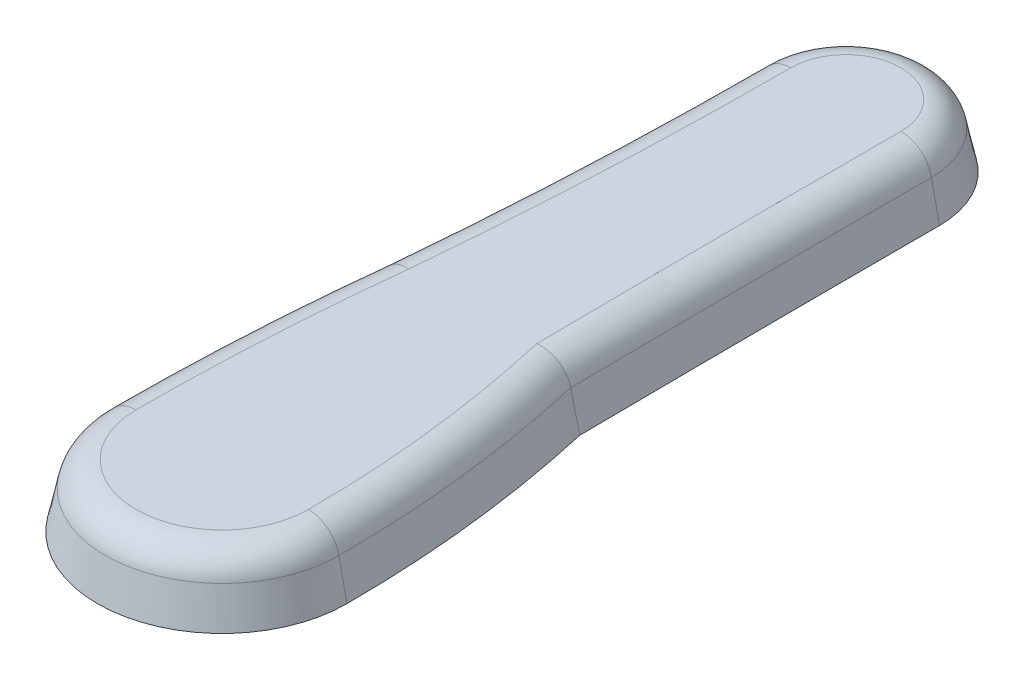
ISO-10303-21;
HEADER;
FILE_DESCRIPTION(('STEP AP214'),'2;1');
FILE_NAME('part.step','',(''),(''),'','','');
FILE_SCHEMA(('AUTOMOTIVE_DESIGN { 1 0 10303 214 1 1 1 1 }'));
ENDSEC;
DATA;
#1=APPLICATION_CONTEXT('core data for automotive mechanical design processes');
#2=APPLICATION_PROTOCOL_DEFINITION('international standard','automotive_design',2000,#1);
#3=PRODUCT_CONTEXT('',#1,'mechanical');
#4=PRODUCT('Part','Part','',(#3));
#5=PRODUCT_RELATED_PRODUCT_CATEGORY('part','',(#4));
#6=PRODUCT_DEFINITION_FORMATION('','',#4);
#7=PRODUCT_DEFINITION_CONTEXT('part definition',#1,'design');
#8=PRODUCT_DEFINITION('design','',#6,#7);
#9=PRODUCT_DEFINITION_SHAPE('','',#8);
#10=(LENGTH_UNIT() NAMED_UNIT(*) SI_UNIT(.MILLI.,.METRE.));
#11=(NAMED_UNIT(*) PLANE_ANGLE_UNIT() SI_UNIT($,.RADIAN.));
#12=(NAMED_UNIT(*) SI_UNIT($,.STERADIAN.) SOLID_ANGLE_UNIT());
#13=UNCERTAINTY_MEASURE_WITH_UNIT(LENGTH_MEASURE(1.E-05),#10,'distance_accuracy_value','');
#14=(GEOMETRIC_REPRESENTATION_CONTEXT(3) GLOBAL_UNCERTAINTY_ASSIGNED_CONTEXT((#13)) GLOBAL_UNIT_ASSIGNED_CONTEXT((#10,
#11,#12)) REPRESENTATION_CONTEXT('',''));
#15=CARTESIAN_POINT('',(0.,0.,0.));
#16=DIRECTION('',(0.,0.,1.));
#17=DIRECTION('',(1.,0.,0.));
#18=AXIS2_PLACEMENT_3D('',#15,#16,#17);
#19=CARTESIAN_POINT('',(-339.218112171444,0.,-7.49400541621981E-13));
#20=DIRECTION('',(0.,-1.,0.));
#21=DIRECTION('',(0.,0.,1.));
#22=AXIS2_PLACEMENT_3D('',#19,#20,#21);
#23=CONICAL_SURFACE('',#22,379.218112171443,0.20943951023932);
#24=CARTESIAN_POINT('',(26.313249291732,20.,-83.5886390645757));
#25=CARTESIAN_POINT('',(27.0209951168616,16.6666712777232,-83.6720068129178));
#26=CARTESIAN_POINT('',(27.7287432435103,13.3333402499073,-83.7552625379664));
#27=CARTESIAN_POINT('',(29.1442440998376,6.66667358323685,-83.9215499414755));
#28=CARTESIAN_POINT('',(29.8519968295162,3.33333794438225,-84.004581619936));
#29=CARTESIAN_POINT('',(30.5597518607139,-1.14080823309209E-11,-84.0875012751029));
#30=B_SPLINE_CURVE_WITH_KNOTS('',3,(#24,#25,#26,#27,#28,#29),.UNSPECIFIED.,.F.,.F.,(4,2,4),(0.,
10.2259675340651,20.4519350680094),.UNSPECIFIED.);
#31=CARTESIAN_POINT('',(27.995046607654,12.0791169081776,-83.7865324187301));
#32=VERTEX_POINT('',#31);
#33=CARTESIAN_POINT('',(30.5597518607073,0.,-84.0875012756157));
#34=VERTEX_POINT('',#33);
#35=EDGE_CURVE('E102',#32,#34,#30,.T.);
#36=ORIENTED_EDGE('',*,*,#35,.F.);
#37=CARTESIAN_POINT('',(-339.218112171444,12.0791169081776,-7.49400541621981E-13));
#38=DIRECTION('',(0.,-1.,0.));
#39=DIRECTION('',(0.,0.,-1.));
#40=AXIS2_PLACEMENT_3D('',#37,#38,#39);
#41=CIRCLE('',#40,376.650616613431);
#42=CARTESIAN_POINT('',(37.4325044419871,12.0791169081776,-1.49524238541269E-13));
#43=VERTEX_POINT('',#42);
#44=EDGE_CURVE('E11',#32,#43,#41,.T.);
#45=ORIENTED_EDGE('',*,*,#44,.T.);
#46=DIRECTION('',(0.207911690817759,-0.978147600733806,0.));
#47=VECTOR('',#46,1.);
#48=CARTESIAN_POINT('',(39.9999999999995,0.,-1.45435091529205E-13));
#49=LINE('',#48,#47);
#50=CARTESIAN_POINT('',(40.,0.,0.));
#51=VERTEX_POINT('',#50);
#52=EDGE_CURVE('E123',#43,#51,#49,.T.);
#53=ORIENTED_EDGE('',*,*,#52,.T.);
#54=CARTESIAN_POINT('',(-339.218112171444,0.,-7.49400541621981E-13));
#55=DIRECTION('',(0.,1.,0.));
#56=DIRECTION('',(0.,0.,1.));
#57=AXIS2_PLACEMENT_3D('',#54,#55,#56);
#58=CIRCLE('',#57,379.218112171443);
#59=EDGE_CURVE('E117',#51,#34,#58,.T.);
#60=ORIENTED_EDGE('',*,*,#59,.T.);
#61=EDGE_LOOP('',(#36,#45,#53,#60));
#62=FACE_BOUND('',#61,.T.);
#63=ADVANCED_FACE('F32',(#62),#23,.T.);
#64=CARTESIAN_POINT('',(12031.7650883575,0.,-200.000000000189));
#65=DIRECTION('',(0.,1.,0.));
#66=DIRECTION('',(0.,0.,-1.));
#67=AXIS2_PLACEMENT_3D('',#64,#65,#66);
#68=CONICAL_SURFACE('',#67,12001.7650883576,0.20943951023932);
#69=DIRECTION('',(0.207911690817759,-0.978147600733806,0.));
#70=VECTOR('',#69,1.);
#71=CARTESIAN_POINT('',(30.,0.,-200.));
#72=LINE('',#71,#70);
#73=CARTESIAN_POINT('',(27.4325044419825,12.0791169082012,-200.));
#74=VERTEX_POINT('',#73);
#75=CARTESIAN_POINT('',(30.,0.,-200.));
#76=VERTEX_POINT('',#75);
#77=EDGE_CURVE('E111',#74,#76,#72,.T.);
#78=ORIENTED_EDGE('',*,*,#77,.F.);
#79=CARTESIAN_POINT('',(12031.7650883575,12.0791169081782,-200.000000000189));
#80=DIRECTION('',(0.,1.,0.));
#81=DIRECTION('',(0.,0.,1.));
#82=AXIS2_PLACEMENT_3D('',#79,#80,#81);
#83=CIRCLE('',#82,12004.3325839156);
#84=EDGE_CURVE('E41',#74,#32,#83,.T.);
#85=ORIENTED_EDGE('',*,*,#84,.T.);
#86=ORIENTED_EDGE('',*,*,#35,.T.);
#87=CARTESIAN_POINT('',(12031.7650883575,0.,-200.000000000189));
#88=DIRECTION('',(0.,-1.,0.));
#89=DIRECTION('',(0.,0.,-1.));
#90=AXIS2_PLACEMENT_3D('',#87,#88,#89);
#91=CIRCLE('',#90,12001.7650883576);
#92=EDGE_CURVE('E105',#34,#76,#91,.T.);
#93=ORIENTED_EDGE('',*,*,#92,.T.);
#94=EDGE_LOOP('',(#78,#85,#86,#93));
#95=FACE_BOUND('',#94,.T.);
#96=ADVANCED_FACE('F104',(#95),#68,.F.);
#97=CARTESIAN_POINT('',(0.,0.,-200.));
#98=DIRECTION('',(0.,-1.,0.));
#99=DIRECTION('',(0.,0.,1.));
#100=AXIS2_PLACEMENT_3D('',#97,#98,#99);
#101=CONICAL_SURFACE('',#100,30.,0.20943951023932);
#102=DIRECTION('',(-0.207911690817759,-0.978147600733806,0.));
#103=VECTOR('',#102,1.);
#104=CARTESIAN_POINT('',(-30.,0.,-200.));
#105=LINE('',#104,#103);
#106=CARTESIAN_POINT('',(-27.4325044419876,12.0791169081776,-200.));
#107=VERTEX_POINT('',#106);
#108=CARTESIAN_POINT('',(-30.,0.,-200.));
#109=VERTEX_POINT('',#108);
#110=EDGE_CURVE('E166',#107,#109,#105,.T.);
#111=ORIENTED_EDGE('',*,*,#110,.F.);
#112=CARTESIAN_POINT('',(0.,12.0791169081776,-200.));
#113=DIRECTION('',(0.,-1.,0.));
#114=DIRECTION('',(0.,0.,-1.));
#115=AXIS2_PLACEMENT_3D('',#112,#113,#114);
#116=CIRCLE('',#115,27.4325044419875);
#117=EDGE_CURVE('E56',#107,#74,#116,.T.);
#118=ORIENTED_EDGE('',*,*,#117,.T.);
#119=ORIENTED_EDGE('',*,*,#77,.T.);
#120=CARTESIAN_POINT('',(0.,0.,-200.));
#121=DIRECTION('',(0.,1.,0.));
#122=DIRECTION('',(0.,0.,1.));
#123=AXIS2_PLACEMENT_3D('',#120,#121,#122);
#124=CIRCLE('',#123,30.);
#125=EDGE_CURVE('E120',#76,#109,#124,.T.);
#126=ORIENTED_EDGE('',*,*,#125,.T.);
#127=EDGE_LOOP('',(#111,#118,#119,#126));
#128=FACE_BOUND('',#127,.T.);
#129=ADVANCED_FACE('F150',(#128),#101,.T.);
#130=CARTESIAN_POINT('',(-1300.45102516732,0.,-200.000000000001));
#131=DIRECTION('',(0.,1.,0.));
#132=DIRECTION('',(0.,0.,1.));
#133=AXIS2_PLACEMENT_3D('',#130,#131,#132);
#134=CONICAL_SURFACE('',#133,1270.45102516732,0.20943951023932);
#135=CARTESIAN_POINT('',(-31.0693738153167,20.,-83.656496771382));
#136=CARTESIAN_POINT('',(-31.7742800585094,16.6666666752837,-83.7283469811816));
#137=CARTESIAN_POINT('',(-32.4791871029981,13.3333333462589,-83.8001891279347));
#138=CARTESIAN_POINT('',(-33.8890027945672,6.66666667959226,-83.9438572953481));
#139=CARTESIAN_POINT('',(-34.5939114416476,3.33333334195042,-84.0156833160084));
#140=CARTESIAN_POINT('',(-35.2988208900239,0.,-84.0875012736222));
#141=B_SPLINE_CURVE_WITH_KNOTS('',3,(#135,#136,#137,#138,#139,#140),.UNSPECIFIED.,.F.,.F.,(4,2,
4),(0.,10.2234288211083,20.4468576422164),.UNSPECIFIED.);
#142=CARTESIAN_POINT('',(-32.7444193087766,12.0791169081776,-83.8272167316079));
#143=VERTEX_POINT('',#142);
#144=CARTESIAN_POINT('',(-35.2988208900231,0.,-84.0875012736288));
#145=VERTEX_POINT('',#144);
#146=EDGE_CURVE('E160',#143,#145,#141,.T.);
#147=ORIENTED_EDGE('',*,*,#146,.F.);
#148=CARTESIAN_POINT('',(-1300.45102516732,12.0791169081775,-200.000000000001));
#149=DIRECTION('',(0.,1.,0.));
#150=DIRECTION('',(0.,0.,1.));
#151=AXIS2_PLACEMENT_3D('',#148,#149,#150);
#152=CIRCLE('',#151,1273.01852072533);
#153=EDGE_CURVE('E187',#143,#107,#152,.T.);
#154=ORIENTED_EDGE('',*,*,#153,.T.);
#155=ORIENTED_EDGE('',*,*,#110,.T.);
#156=CARTESIAN_POINT('',(-1300.45102516732,0.,-200.000000000001));
#157=DIRECTION('',(0.,-1.,0.));
#158=DIRECTION('',(0.,0.,1.));
#159=AXIS2_PLACEMENT_3D('',#156,#157,#158);
#160=CIRCLE('',#159,1270.45102516732);
#161=EDGE_CURVE('E130',#109,#145,#160,.T.);
#162=ORIENTED_EDGE('',*,*,#161,.T.);
#163=EDGE_LOOP('',(#147,#154,#155,#162));
#164=FACE_BOUND('',#163,.T.);
#165=ADVANCED_FACE('F151',(#164),#134,.F.);
#166=CARTESIAN_POINT('',(714.364893310936,0.,0.));
#167=DIRECTION('',(0.,-1.,0.));
#168=DIRECTION('',(0.,0.,1.));
#169=AXIS2_PLACEMENT_3D('',#166,#167,#168);
#170=CONICAL_SURFACE('',#169,754.364893310936,0.20943951023932);
#171=DIRECTION('',(-0.207911690817759,-0.978147600733806,0.));
#172=VECTOR('',#171,1.);
#173=CARTESIAN_POINT('',(-40.,0.,0.));
#174=LINE('',#173,#172);
#175=CARTESIAN_POINT('',(-37.4325044419875,12.0791169081776,0.));
#176=VERTEX_POINT('',#175);
#177=CARTESIAN_POINT('',(-40.,0.,0.));
#178=VERTEX_POINT('',#177);
#179=EDGE_CURVE('E167',#176,#178,#174,.T.);
#180=ORIENTED_EDGE('',*,*,#179,.F.);
#181=CARTESIAN_POINT('',(714.364893310936,12.0791169081776,0.));
#182=DIRECTION('',(0.,-1.,0.));
#183=DIRECTION('',(0.,0.,-1.));
#184=AXIS2_PLACEMENT_3D('',#181,#182,#183);
#185=CIRCLE('',#184,751.797397752924);
#186=EDGE_CURVE('E185',#176,#143,#185,.T.);
#187=ORIENTED_EDGE('',*,*,#186,.T.);
#188=ORIENTED_EDGE('',*,*,#146,.T.);
#189=CARTESIAN_POINT('',(714.364893310936,0.,0.));
#190=DIRECTION('',(0.,1.,0.));
#191=DIRECTION('',(0.,0.,1.));
#192=AXIS2_PLACEMENT_3D('',#189,#190,#191);
#193=CIRCLE('',#192,754.364893310936);
#194=EDGE_CURVE('E133',#145,#178,#193,.T.);
#195=ORIENTED_EDGE('',*,*,#194,.T.);
#196=EDGE_LOOP('',(#180,#187,#188,#195));
#197=FACE_BOUND('',#196,.T.);
#198=ADVANCED_FACE('F155',(#197),#170,.T.);
#199=CARTESIAN_POINT('',(0.,0.,0.));
#200=DIRECTION('',(0.,-1.,0.));
#201=DIRECTION('',(0.,0.,1.));
#202=AXIS2_PLACEMENT_3D('',#199,#200,#201);
#203=CONICAL_SURFACE('',#202,40.,0.20943951023932);
#204=ORIENTED_EDGE('',*,*,#52,.F.);
#205=CARTESIAN_POINT('',(0.,12.0791169081776,0.));
#206=DIRECTION('',(0.,-1.,0.));
#207=DIRECTION('',(0.,0.,-1.));
#208=AXIS2_PLACEMENT_3D('',#205,#206,#207);
#209=CIRCLE('',#208,37.4325044419875);
#210=EDGE_CURVE('E182',#43,#176,#209,.T.);
#211=ORIENTED_EDGE('',*,*,#210,.T.);
#212=ORIENTED_EDGE('',*,*,#179,.T.);
#213=CARTESIAN_POINT('',(0.,0.,0.));
#214=DIRECTION('',(0.,1.,0.));
#215=DIRECTION('',(0.,0.,1.));
#216=AXIS2_PLACEMENT_3D('',#213,#214,#215);
#217=CIRCLE('',#216,40.);
#218=EDGE_CURVE('E136',#178,#51,#217,.T.);
#219=ORIENTED_EDGE('',*,*,#218,.T.);
#220=EDGE_LOOP('',(#204,#211,#212,#219));
#221=FACE_BOUND('',#220,.T.);
#222=ADVANCED_FACE('F256',(#221),#203,.T.);
#223=CARTESIAN_POINT('',(5846.27348809301,20.,-100.000000000095));
#224=DIRECTION('',(0.,1.,0.));
#225=DIRECTION('',(0.,0.,1.));
#226=AXIS2_PLACEMENT_3D('',#223,#224,#225);
#227=PLANE('',#226);
#228=CARTESIAN_POINT('',(714.364893310936,20.,0.));
#229=DIRECTION('',(0.,1.,0.));
#230=DIRECTION('',(0.,0.,1.));
#231=AXIS2_PLACEMENT_3D('',#228,#229,#230);
#232=CIRCLE('',#231,742.015921745586);
#233=CARTESIAN_POINT('',(-23.0128922210465,20.,-82.8349535395572));
#234=VERTEX_POINT('',#233);
#235=CARTESIAN_POINT('',(-27.6510284346496,20.,0.));
#236=VERTEX_POINT('',#235);
#237=EDGE_CURVE('E177',#234,#236,#232,.T.);
#238=ORIENTED_EDGE('',*,*,#237,.T.);
#239=CARTESIAN_POINT('',(0.,20.,0.));
#240=DIRECTION('',(0.,1.,0.));
#241=DIRECTION('',(0.,0.,1.));
#242=AXIS2_PLACEMENT_3D('',#239,#240,#241);
#243=CIRCLE('',#242,27.6510284346495);
#244=CARTESIAN_POINT('',(27.6510284346489,20.,-1.10452106617168E-13));
#245=VERTEX_POINT('',#244);
#246=EDGE_CURVE('E179',#236,#245,#243,.T.);
#247=ORIENTED_EDGE('',*,*,#246,.T.);
#248=CARTESIAN_POINT('',(-339.218112171444,20.,-7.49400541621981E-13));
#249=DIRECTION('',(0.,1.,0.));
#250=DIRECTION('',(0.,0.,1.));
#251=AXIS2_PLACEMENT_3D('',#248,#249,#250);
#252=CIRCLE('',#251,366.869140606093);
#253=CARTESIAN_POINT('',(18.2243478938735,20.,-82.6308300303659));
#254=VERTEX_POINT('',#253);
#255=EDGE_CURVE('E110',#245,#254,#252,.T.);
#256=ORIENTED_EDGE('',*,*,#255,.T.);
#257=CARTESIAN_POINT('',(12031.7650883575,20.,-200.000000000189));
#258=DIRECTION('',(0.,1.,0.));
#259=DIRECTION('',(0.,0.,1.));
#260=AXIS2_PLACEMENT_3D('',#257,#258,#259);
#261=CIRCLE('',#260,12014.1140599229);
#262=CARTESIAN_POINT('',(17.651028434534,20.,-200.));
#263=VERTEX_POINT('',#262);
#264=EDGE_CURVE('E171',#254,#263,#261,.F.);
#265=ORIENTED_EDGE('',*,*,#264,.T.);
#266=CARTESIAN_POINT('',(0.,20.,-200.));
#267=DIRECTION('',(0.,1.,0.));
#268=DIRECTION('',(0.,0.,1.));
#269=AXIS2_PLACEMENT_3D('',#266,#267,#268);
#270=CIRCLE('',#269,17.6510284346495);
#271=CARTESIAN_POINT('',(-17.6510284346495,20.,-200.));
#272=VERTEX_POINT('',#271);
#273=EDGE_CURVE('E173',#263,#272,#270,.T.);
#274=ORIENTED_EDGE('',*,*,#273,.T.);
#275=CARTESIAN_POINT('',(-1300.45102516732,20.,-200.000000000001));
#276=DIRECTION('',(0.,1.,0.));
#277=DIRECTION('',(0.,0.,1.));
#278=AXIS2_PLACEMENT_3D('',#275,#276,#277);
#279=CIRCLE('',#278,1282.79999673267);
#280=EDGE_CURVE('E175',#272,#234,#279,.F.);
#281=ORIENTED_EDGE('',*,*,#280,.T.);
#282=EDGE_LOOP('',(#238,#247,#256,#265,#274,#281));
#283=FACE_BOUND('',#282,.T.);
#284=ADVANCED_FACE('F263',(#283),#227,.T.);
#285=CARTESIAN_POINT('',(5846.27348809301,0.,-100.000000000095));
#286=DIRECTION('',(0.,1.,0.));
#287=DIRECTION('',(0.,0.,1.));
#288=AXIS2_PLACEMENT_3D('',#285,#286,#287);
#289=PLANE('',#288);
#290=ORIENTED_EDGE('',*,*,#59,.F.);
#291=ORIENTED_EDGE('',*,*,#218,.F.);
#292=ORIENTED_EDGE('',*,*,#194,.F.);
#293=ORIENTED_EDGE('',*,*,#161,.F.);
#294=ORIENTED_EDGE('',*,*,#125,.F.);
#295=ORIENTED_EDGE('',*,*,#92,.F.);
#296=EDGE_LOOP('',(#290,#291,#292,#293,#294,#295));
#297=FACE_BOUND('',#296,.T.);
#298=ADVANCED_FACE('F115',(#297),#289,.F.);
#299=CARTESIAN_POINT('',(0.,10.,-200.));
#300=DIRECTION('',(0.,1.,0.));
#301=DIRECTION('',(0.,0.,1.));
#302=AXIS2_PLACEMENT_3D('',#299,#300,#301);
#303=TOROIDAL_SURFACE('',#302,17.6510284346495,10.);
#304=CARTESIAN_POINT('',(17.6510284346495,10.,-200.));
#305=DIRECTION('',(0.,0.,1.));
#306=DIRECTION('',(1.,0.,0.));
#307=AXIS2_PLACEMENT_3D('',#304,#305,#306);
#308=CIRCLE('',#307,10.);
#309=EDGE_CURVE('E127',#74,#263,#308,.T.);
#310=ORIENTED_EDGE('',*,*,#309,.F.);
#311=ORIENTED_EDGE('',*,*,#117,.F.);
#312=CARTESIAN_POINT('',(-17.6510284346495,10.,-200.));
#313=DIRECTION('',(0.,0.,1.));
#314=DIRECTION('',(1.,0.,0.));
#315=AXIS2_PLACEMENT_3D('',#312,#313,#314);
#316=CIRCLE('',#315,10.);
#317=EDGE_CURVE('E36',#272,#107,#316,.T.);
#318=ORIENTED_EDGE('',*,*,#317,.F.);
#319=ORIENTED_EDGE('',*,*,#273,.F.);
#320=EDGE_LOOP('',(#310,#311,#318,#319));
#321=FACE_BOUND('',#320,.T.);
#322=ADVANCED_FACE('F34',(#321),#303,.T.);
#323=CARTESIAN_POINT('',(-1300.45102516732,10.,-200.000000000001));
#324=DIRECTION('',(0.,1.,0.));
#325=DIRECTION('',(0.,0.,1.));
#326=AXIS2_PLACEMENT_3D('',#323,#324,#325);
#327=TOROIDAL_SURFACE('',#326,1282.79999673267,10.);
#328=ORIENTED_EDGE('',*,*,#317,.T.);
#329=ORIENTED_EDGE('',*,*,#153,.F.);
#330=CARTESIAN_POINT('',(-32.7444193087765,12.0791169081776,-83.8272167316079));
#331=CARTESIAN_POINT('',(-32.6862748169127,12.3542132812801,-83.8212911931233));
#332=CARTESIAN_POINT('',(-32.616528088939,12.6268261461844,-83.8141832259401));
#333=CARTESIAN_POINT('',(-32.4544572227862,13.165170902428,-83.7976661472564));
#334=CARTESIAN_POINT('',(-32.3621341652445,13.4309031224429,-83.7882571458969));
#335=CARTESIAN_POINT('',(-32.1555960110802,13.9534374242886,-83.7672076546227));
#336=CARTESIAN_POINT('',(-32.0413945117155,14.2102449362431,-83.7555685506964));
#337=CARTESIAN_POINT('',(-31.7918848906068,14.7132779328413,-83.7301386579074));
#338=CARTESIAN_POINT('',(-31.6565770256888,14.9595035462009,-83.7163478952265));
#339=CARTESIAN_POINT('',(-31.3657408817635,15.4397448104627,-83.686704733899));
#340=CARTESIAN_POINT('',(-31.2102026440056,15.6737543677662,-83.6708513198754));
#341=CARTESIAN_POINT('',(-30.8800612697056,16.1277735766077,-83.6372003313063));
#342=CARTESIAN_POINT('',(-30.7054577306597,16.3477829324201,-83.6194027157152));
#343=CARTESIAN_POINT('',(-30.3384959059953,16.7721559654632,-83.5819965523611));
#344=CARTESIAN_POINT('',(-30.1461439872759,16.9765252055332,-83.5623886540018));
#345=CARTESIAN_POINT('',(-29.7450012010855,17.3682515183517,-83.5214957300708));
#346=CARTESIAN_POINT('',(-29.5362104561139,17.5556087178486,-83.5002107169967));
#347=CARTESIAN_POINT('',(-29.1037103357568,17.9119504899212,-83.4561182274385));
#348=CARTESIAN_POINT('',(-28.8800035596953,18.0809382501946,-83.4333110162177));
#349=CARTESIAN_POINT('',(-28.4192281827312,18.3993784094739,-83.3863325360011));
#350=CARTESIAN_POINT('',(-28.1821595781598,18.548830803116,-83.3621612666307));
#351=CARTESIAN_POINT('',(-27.6961520078776,18.8272492842151,-83.3126064432496));
#352=CARTESIAN_POINT('',(-27.4472037741466,18.9561990250095,-83.2872219426985));
#353=CARTESIAN_POINT('',(-26.9393930525454,19.1925466318264,-83.235439844295));
#354=CARTESIAN_POINT('',(-26.6805310064664,19.299945456899,-83.2090422915874));
#355=CARTESIAN_POINT('',(-26.1560785403801,19.4919394341744,-83.155558744653));
#356=CARTESIAN_POINT('',(-25.8905295526817,19.5766489816268,-83.1284769873929));
#357=CARTESIAN_POINT('',(-25.3533069346215,19.7233898157821,-83.0736864437824));
#358=CARTESIAN_POINT('',(-25.0816335260339,19.7854219222731,-83.0459776801367));
#359=CARTESIAN_POINT('',(-24.5347395742508,19.8862551175742,-82.9901958743422));
#360=CARTESIAN_POINT('',(-24.2595290541588,19.9251113440134,-82.962123860441));
#361=CARTESIAN_POINT('',(-23.7069588511562,19.9795331419864,-82.9057580739101));
#362=CARTESIAN_POINT('',(-23.4296006391231,19.9951134426436,-82.8774644529208));
#363=CARTESIAN_POINT('',(-23.105753230243,19.9996736563566,-82.8444269287874));
#364=CARTESIAN_POINT('',(-23.0593209626673,20.000000454238,-82.8396900722269));
#365=CARTESIAN_POINT('',(-23.0128922210461,20.,-82.8349535395626));
#366=B_SPLINE_CURVE_WITH_KNOTS('',3,(#330,#331,#332,#333,#334,#335,#336,#337,#338,#339,#340,
#341,#342,#343,#344,#345,#346,#347,#348,#349,#350,#351,#352,#353,#354,#355,#356,#357,#358,#359,
#360,#361,#362,#363,#364,#365),.UNSPECIFIED.,.F.,.F.,(4,2,2,2,2,2,2,2,2,2,2,2,2,2,2,2,2,4),(0.,
0.843451607391733,1.68686285007601,2.52975161069253,3.37263011568808,4.2159251237699,
5.05923793881816,5.90224939869146,6.74525457718225,7.58811323242355,8.43097211909249,
9.27449967913941,10.1179896925333,10.9571433196669,11.796266608455,12.6333854964248,
13.4699744266156,13.6099924465256),.UNSPECIFIED.);
#367=EDGE_CURVE('E204',#234,#143,#366,.F.);
#368=ORIENTED_EDGE('',*,*,#367,.F.);
#369=ORIENTED_EDGE('',*,*,#280,.F.);
#370=EDGE_LOOP('',(#328,#329,#368,#369));
#371=FACE_BOUND('',#370,.T.);
#372=ADVANCED_FACE('F222',(#371),#327,.T.);
#373=CARTESIAN_POINT('',(12031.7650883575,10.,-200.000000000189));
#374=DIRECTION('',(0.,1.,0.));
#375=DIRECTION('',(0.,0.,1.));
#376=AXIS2_PLACEMENT_3D('',#373,#374,#375);
#377=TOROIDAL_SURFACE('',#376,12014.1140599229,10.);
#378=ORIENTED_EDGE('',*,*,#309,.T.);
#379=ORIENTED_EDGE('',*,*,#264,.F.);
#380=CARTESIAN_POINT('',(27.9950466076534,12.0791169081777,-83.7865324187303));
#381=CARTESIAN_POINT('',(27.9367926461148,12.3536285374772,-83.7796850458444));
#382=CARTESIAN_POINT('',(27.8669435830902,12.6256378684911,-83.7714742182595));
#383=CARTESIAN_POINT('',(27.7047066124767,13.1627349453566,-83.7523995973338));
#384=CARTESIAN_POINT('',(27.6123202595941,13.4278231672563,-83.7415359869917));
#385=CARTESIAN_POINT('',(27.4057346229782,13.9489906184639,-83.7172385142872));
#386=CARTESIAN_POINT('',(27.291552870194,14.205076893705,-83.7038067176096));
#387=CARTESIAN_POINT('',(27.0421750515813,14.7066529716447,-83.674463479744));
#388=CARTESIAN_POINT('',(26.9069791349717,14.952142849571,-83.6585520561635));
#389=CARTESIAN_POINT('',(26.6164983498146,15.4308925492192,-83.6243547118099));
#390=CARTESIAN_POINT('',(26.4612056007957,15.6641475226381,-83.6060678595611));
#391=CARTESIAN_POINT('',(26.1316964607683,16.1166939371926,-83.5672527508684));
#392=CARTESIAN_POINT('',(25.9574795993514,16.3359850310045,-83.5467244387069));
#393=CARTESIAN_POINT('',(25.5914466814941,16.7589949588902,-83.5035781201709));
#394=CARTESIAN_POINT('',(25.3996367537053,16.9627191707893,-83.4809608414815));
#395=CARTESIAN_POINT('',(24.9997435005439,17.3532678120126,-83.4337884696796));
#396=CARTESIAN_POINT('',(24.7916602241066,17.540092292152,-83.4092333823942));
#397=CARTESIAN_POINT('',(24.3599872580716,17.8961470621515,-83.3582714095091));
#398=CARTESIAN_POINT('',(24.1363483511081,18.0653168405052,-83.3318586430498));
#399=CARTESIAN_POINT('',(23.6757779438975,18.3841854964675,-83.2774382349507));
#400=CARTESIAN_POINT('',(23.4388463507159,18.5338842379219,-83.2494305821604));
#401=CARTESIAN_POINT('',(22.9531367598356,18.8129205620513,-83.1919872243257));
#402=CARTESIAN_POINT('',(22.7043474478916,18.9422381698197,-83.1625501548539));
#403=CARTESIAN_POINT('',(22.1969060098986,19.1794502429056,-83.1024788402966));
#404=CARTESIAN_POINT('',(21.9382540826431,19.2873451397532,-83.0718446193409));
#405=CARTESIAN_POINT('',(21.4028104224693,19.4847024471892,-83.0083947775099));
#406=CARTESIAN_POINT('',(21.1257034951236,19.573298320333,-82.975540560524));
#407=CARTESIAN_POINT('',(20.5649119660322,19.7259540302059,-82.9090154228342));
#408=CARTESIAN_POINT('',(20.2812275036144,19.7900143861535,-82.8753445194289));
#409=CARTESIAN_POINT('',(19.7101740858169,19.8930058195777,-82.8075271710577));
#410=CARTESIAN_POINT('',(19.4228164871297,19.9320011229103,-82.7733821723718));
#411=CARTESIAN_POINT('',(18.8459769810867,19.9848224089027,-82.7048007842273));
#412=CARTESIAN_POINT('',(18.5564968461901,19.9986674193261,-82.6703646348764));
#413=CARTESIAN_POINT('',(18.2528548649801,19.9999694944274,-82.634223252441));
#414=CARTESIAN_POINT('',(18.2386011923873,20.0000000393611,-82.6325266429358));
#415=CARTESIAN_POINT('',(18.2243478938753,20.,-82.6308300303581));
#416=B_SPLINE_CURVE_WITH_KNOTS('',3,(#380,#381,#382,#383,#384,#385,#386,#387,#388,#389,#390,
#391,#392,#393,#394,#395,#396,#397,#398,#399,#400,#401,#402,#403,#404,#405,#406,#407,#408,#409,
#410,#411,#412,#413,#414,#415),.UNSPECIFIED.,.F.,.F.,(4,2,2,2,2,2,2,2,2,2,2,2,2,2,2,2,2,4),(0.,
0.841862904336293,1.68366775024303,2.52479832900089,3.36592293527183,4.20737837266314,
5.04885473142246,5.89003906210121,6.73122086336552,7.575197154107,8.41917934616274,
9.26398362273913,10.1087708802079,10.985986347372,11.8631832499553,12.738123396449,
13.6124013200819,13.6554641383371),.UNSPECIFIED.);
#417=EDGE_CURVE('E195',#32,#254,#416,.T.);
#418=ORIENTED_EDGE('',*,*,#417,.F.);
#419=ORIENTED_EDGE('',*,*,#84,.F.);
#420=EDGE_LOOP('',(#378,#379,#418,#419));
#421=FACE_BOUND('',#420,.T.);
#422=ADVANCED_FACE('F210',(#421),#377,.T.);
#423=CARTESIAN_POINT('',(714.364893310936,10.,0.));
#424=DIRECTION('',(0.,1.,0.));
#425=DIRECTION('',(0.,0.,1.));
#426=AXIS2_PLACEMENT_3D('',#423,#424,#425);
#427=TOROIDAL_SURFACE('',#426,742.015921745586,10.);
#428=ORIENTED_EDGE('',*,*,#367,.T.);
#429=ORIENTED_EDGE('',*,*,#186,.F.);
#430=CARTESIAN_POINT('',(-27.6510284346496,10.,0.));
#431=DIRECTION('',(0.,0.,1.));
#432=DIRECTION('',(1.,0.,0.));
#433=AXIS2_PLACEMENT_3D('',#430,#431,#432);
#434=CIRCLE('',#433,10.);
#435=EDGE_CURVE('E193',#236,#176,#434,.T.);
#436=ORIENTED_EDGE('',*,*,#435,.F.);
#437=ORIENTED_EDGE('',*,*,#237,.F.);
#438=EDGE_LOOP('',(#428,#429,#436,#437));
#439=FACE_BOUND('',#438,.T.);
#440=ADVANCED_FACE('F217',(#439),#427,.T.);
#441=CARTESIAN_POINT('',(-339.218112171444,10.,-7.49400541621981E-13));
#442=DIRECTION('',(0.,1.,0.));
#443=DIRECTION('',(0.,0.,1.));
#444=AXIS2_PLACEMENT_3D('',#441,#442,#443);
#445=TOROIDAL_SURFACE('',#444,366.869140606093,10.);
#446=ORIENTED_EDGE('',*,*,#417,.T.);
#447=ORIENTED_EDGE('',*,*,#255,.F.);
#448=CARTESIAN_POINT('',(27.651028434649,10.,-1.65102802353837E-13));
#449=DIRECTION('',(0.,0.,1.));
#450=DIRECTION('',(0.,-1.,0.));
#451=AXIS2_PLACEMENT_3D('',#448,#449,#450);
#452=CIRCLE('',#451,10.);
#453=EDGE_CURVE('E191',#43,#245,#452,.T.);
#454=ORIENTED_EDGE('',*,*,#453,.F.);
#455=ORIENTED_EDGE('',*,*,#44,.F.);
#456=EDGE_LOOP('',(#446,#447,#454,#455));
#457=FACE_BOUND('',#456,.T.);
#458=ADVANCED_FACE('F213',(#457),#445,.T.);
#459=CARTESIAN_POINT('',(0.,10.,0.));
#460=DIRECTION('',(0.,1.,0.));
#461=DIRECTION('',(0.,0.,1.));
#462=AXIS2_PLACEMENT_3D('',#459,#460,#461);
#463=TOROIDAL_SURFACE('',#462,27.6510284346495,10.);
#464=ORIENTED_EDGE('',*,*,#435,.T.);
#465=ORIENTED_EDGE('',*,*,#210,.F.);
#466=ORIENTED_EDGE('',*,*,#453,.T.);
#467=ORIENTED_EDGE('',*,*,#246,.F.);
#468=EDGE_LOOP('',(#464,#465,#466,#467));
#469=FACE_BOUND('',#468,.T.);
#470=ADVANCED_FACE('F216',(#469),#463,.T.);
#471=CLOSED_SHELL('',(#63,#96,#129,#165,#198,#222,#284,#298,#322,#372,#422,#440,#458,#470));
#472=MANIFOLD_SOLID_BREP('B2',#471);
#473=ADVANCED_BREP_SHAPE_REPRESENTATION('',(#18,#472),#14);
#474=SHAPE_DEFINITION_REPRESENTATION(#9,#473);
ENDSEC;
END-ISO-10303-21;
